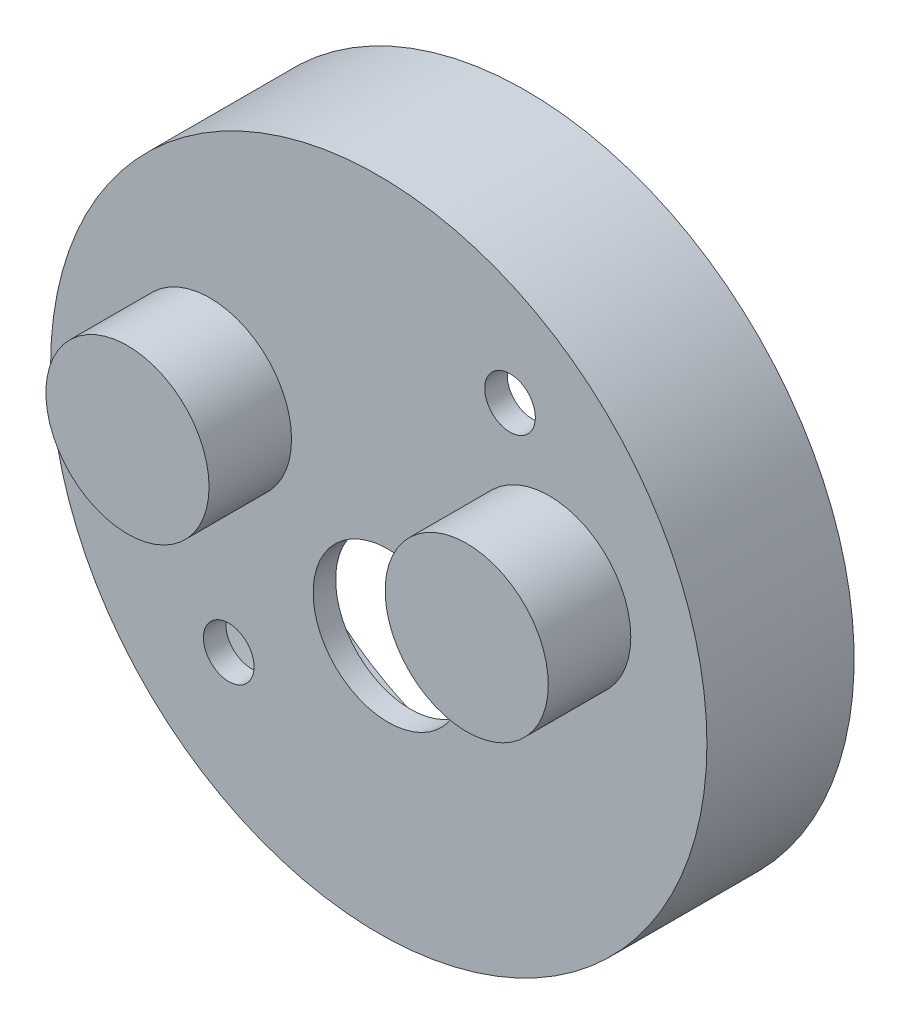
ISO-10303-21;
HEADER;
FILE_DESCRIPTION(('STEP AP214'),'2;1');
FILE_NAME('part.step','',(''),(''),'','','');
FILE_SCHEMA(('AUTOMOTIVE_DESIGN { 1 0 10303 214 1 1 1 1 }'));
ENDSEC;
DATA;
#1=APPLICATION_CONTEXT('core data for automotive mechanical design processes');
#2=APPLICATION_PROTOCOL_DEFINITION('international standard','automotive_design',2000,#1);
#3=PRODUCT_CONTEXT('',#1,'mechanical');
#4=PRODUCT('Part','Part','',(#3));
#5=PRODUCT_RELATED_PRODUCT_CATEGORY('part','',(#4));
#6=PRODUCT_DEFINITION_FORMATION('','',#4);
#7=PRODUCT_DEFINITION_CONTEXT('part definition',#1,'design');
#8=PRODUCT_DEFINITION('design','',#6,#7);
#9=PRODUCT_DEFINITION_SHAPE('','',#8);
#10=(LENGTH_UNIT() NAMED_UNIT(*) SI_UNIT(.MILLI.,.METRE.));
#11=(NAMED_UNIT(*) PLANE_ANGLE_UNIT() SI_UNIT($,.RADIAN.));
#12=(NAMED_UNIT(*) SI_UNIT($,.STERADIAN.) SOLID_ANGLE_UNIT());
#13=UNCERTAINTY_MEASURE_WITH_UNIT(LENGTH_MEASURE(1.E-05),#10,'distance_accuracy_value','');
#14=(GEOMETRIC_REPRESENTATION_CONTEXT(3) GLOBAL_UNCERTAINTY_ASSIGNED_CONTEXT((#13)) GLOBAL_UNIT_ASSIGNED_CONTEXT((#10,
#11,#12)) REPRESENTATION_CONTEXT('',''));
#15=CARTESIAN_POINT('',(0.,0.,0.));
#16=DIRECTION('',(0.,0.,1.));
#17=DIRECTION('',(1.,0.,0.));
#18=AXIS2_PLACEMENT_3D('',#15,#16,#17);
#19=CARTESIAN_POINT('',(70.0004556794782,-49.4998279755122,5.85));
#20=DIRECTION('',(0.,0.,-1.));
#21=DIRECTION('',(-1.,0.,0.));
#22=AXIS2_PLACEMENT_3D('',#19,#20,#21);
#23=CYLINDRICAL_SURFACE('',#22,17.5);
#24=CARTESIAN_POINT('',(70.0004556794782,-49.4998279755122,5.85));
#25=DIRECTION('',(0.,0.,1.));
#26=DIRECTION('',(1.,0.,0.));
#27=AXIS2_PLACEMENT_3D('',#24,#25,#26);
#28=CIRCLE('',#27,17.5);
#29=CARTESIAN_POINT('',(87.5004556794782,-49.4998279755122,5.85));
#30=VERTEX_POINT('',#29);
#31=EDGE_CURVE('E10',#30,#30,#28,.T.);
#32=ORIENTED_EDGE('',*,*,#31,.F.);
#33=EDGE_LOOP('',(#32));
#34=FACE_BOUND('',#33,.T.);
#35=CARTESIAN_POINT('',(70.0004556794782,-49.4998279755122,-2.));
#36=DIRECTION('',(0.,0.,-1.));
#37=DIRECTION('',(-1.,0.,0.));
#38=AXIS2_PLACEMENT_3D('',#35,#36,#37);
#39=CIRCLE('',#38,17.5);
#40=CARTESIAN_POINT('',(52.5004556794782,-49.4998279755122,-2.));
#41=VERTEX_POINT('',#40);
#42=EDGE_CURVE('E98',#41,#41,#39,.T.);
#43=ORIENTED_EDGE('',*,*,#42,.F.);
#44=EDGE_LOOP('',(#43));
#45=FACE_BOUND('',#44,.T.);
#46=ADVANCED_FACE('F43',(#34,#45),#23,.T.);
#47=CARTESIAN_POINT('',(70.0004556794782,-49.4998279755122,5.85));
#48=DIRECTION('',(0.,0.,1.));
#49=DIRECTION('',(1.,0.,0.));
#50=AXIS2_PLACEMENT_3D('',#47,#48,#49);
#51=PLANE('',#50);
#52=CARTESIAN_POINT('',(77.,-39.0000376139426,5.85));
#53=DIRECTION('',(0.,0.,1.));
#54=DIRECTION('',(1.,0.,0.));
#55=AXIS2_PLACEMENT_3D('',#52,#53,#54);
#56=CIRCLE('',#55,1.35000000000001);
#57=CARTESIAN_POINT('',(78.35,-39.0000376139426,5.85));
#58=VERTEX_POINT('',#57);
#59=EDGE_CURVE('E63',#58,#58,#56,.F.);
#60=ORIENTED_EDGE('',*,*,#59,.T.);
#61=EDGE_LOOP('',(#60));
#62=FACE_BOUND('',#61,.T.);
#63=CARTESIAN_POINT('',(62.,-58.0169590659114,5.85));
#64=DIRECTION('',(0.,0.,1.));
#65=DIRECTION('',(1.,0.,0.));
#66=AXIS2_PLACEMENT_3D('',#63,#64,#65);
#67=CIRCLE('',#66,1.35000000000001);
#68=CARTESIAN_POINT('',(63.35,-58.0169590659114,5.85));
#69=VERTEX_POINT('',#68);
#70=EDGE_CURVE('E68',#69,#69,#67,.F.);
#71=ORIENTED_EDGE('',*,*,#70,.T.);
#72=EDGE_LOOP('',(#71));
#73=FACE_BOUND('',#72,.T.);
#74=CARTESIAN_POINT('',(70.5,-53.,5.85));
#75=DIRECTION('',(0.,0.,1.));
#76=DIRECTION('',(1.,0.,0.));
#77=AXIS2_PLACEMENT_3D('',#74,#75,#76);
#78=CIRCLE('',#77,4.00000000000001);
#79=CARTESIAN_POINT('',(74.5,-53.,5.85));
#80=VERTEX_POINT('',#79);
#81=EDGE_CURVE('E71',#80,#80,#78,.F.);
#82=ORIENTED_EDGE('',*,*,#81,.T.);
#83=EDGE_LOOP('',(#82));
#84=FACE_BOUND('',#83,.T.);
#85=CARTESIAN_POINT('',(79.090811,-46.590809,5.85));
#86=DIRECTION('',(0.,0.,1.));
#87=DIRECTION('',(1.,0.,0.));
#88=AXIS2_PLACEMENT_3D('',#85,#86,#87);
#89=CIRCLE('',#88,4.35000000000001);
#90=CARTESIAN_POINT('',(83.440811,-46.590809,5.85));
#91=VERTEX_POINT('',#90);
#92=EDGE_CURVE('E50',#91,#91,#89,.F.);
#93=ORIENTED_EDGE('',*,*,#92,.T.);
#94=EDGE_LOOP('',(#93));
#95=FACE_BOUND('',#94,.T.);
#96=CARTESIAN_POINT('',(61.,-46.5,5.85));
#97=DIRECTION('',(0.,0.,1.));
#98=DIRECTION('',(1.,0.,0.));
#99=AXIS2_PLACEMENT_3D('',#96,#97,#98);
#100=CIRCLE('',#99,4.35000000000001);
#101=CARTESIAN_POINT('',(65.35,-46.5,5.85));
#102=VERTEX_POINT('',#101);
#103=EDGE_CURVE('E54',#102,#102,#100,.F.);
#104=ORIENTED_EDGE('',*,*,#103,.T.);
#105=EDGE_LOOP('',(#104));
#106=FACE_BOUND('',#105,.T.);
#107=ORIENTED_EDGE('',*,*,#31,.T.);
#108=EDGE_LOOP('',(#107));
#109=FACE_BOUND('',#108,.T.);
#110=ADVANCED_FACE('F106',(#62,#73,#84,#95,#106,#109),#51,.T.);
#111=CARTESIAN_POINT('',(61.,-46.5,10.25));
#112=DIRECTION('',(0.,0.,-1.));
#113=DIRECTION('',(-1.,0.,0.));
#114=AXIS2_PLACEMENT_3D('',#111,#112,#113);
#115=CYLINDRICAL_SURFACE('',#114,4.35000000000001);
#116=ORIENTED_EDGE('',*,*,#103,.F.);
#117=EDGE_LOOP('',(#116));
#118=FACE_BOUND('',#117,.T.);
#119=CARTESIAN_POINT('',(61.,-46.5,10.25));
#120=DIRECTION('',(0.,0.,1.));
#121=DIRECTION('',(1.,0.,0.));
#122=AXIS2_PLACEMENT_3D('',#119,#120,#121);
#123=CIRCLE('',#122,4.35000000000001);
#124=CARTESIAN_POINT('',(65.35,-46.5,10.25));
#125=VERTEX_POINT('',#124);
#126=EDGE_CURVE('E60',#125,#125,#123,.T.);
#127=ORIENTED_EDGE('',*,*,#126,.F.);
#128=EDGE_LOOP('',(#127));
#129=FACE_BOUND('',#128,.T.);
#130=ADVANCED_FACE('F113',(#118,#129),#115,.T.);
#131=CARTESIAN_POINT('',(61.,-46.5,10.25));
#132=DIRECTION('',(0.,0.,1.));
#133=DIRECTION('',(1.,0.,0.));
#134=AXIS2_PLACEMENT_3D('',#131,#132,#133);
#135=PLANE('',#134);
#136=ORIENTED_EDGE('',*,*,#126,.T.);
#137=EDGE_LOOP('',(#136));
#138=FACE_BOUND('',#137,.T.);
#139=ADVANCED_FACE('F120',(#138),#135,.T.);
#140=CARTESIAN_POINT('',(79.090811,-46.590809,10.25));
#141=DIRECTION('',(0.,0.,-1.));
#142=DIRECTION('',(-1.,0.,0.));
#143=AXIS2_PLACEMENT_3D('',#140,#141,#142);
#144=CYLINDRICAL_SURFACE('',#143,4.35000000000001);
#145=ORIENTED_EDGE('',*,*,#92,.F.);
#146=EDGE_LOOP('',(#145));
#147=FACE_BOUND('',#146,.T.);
#148=CARTESIAN_POINT('',(79.090811,-46.590809,10.25));
#149=DIRECTION('',(0.,0.,1.));
#150=DIRECTION('',(1.,0.,0.));
#151=AXIS2_PLACEMENT_3D('',#148,#149,#150);
#152=CIRCLE('',#151,4.35000000000001);
#153=CARTESIAN_POINT('',(83.440811,-46.590809,10.25));
#154=VERTEX_POINT('',#153);
#155=EDGE_CURVE('E59',#154,#154,#152,.T.);
#156=ORIENTED_EDGE('',*,*,#155,.F.);
#157=EDGE_LOOP('',(#156));
#158=FACE_BOUND('',#157,.T.);
#159=ADVANCED_FACE('F126',(#147,#158),#144,.T.);
#160=CARTESIAN_POINT('',(79.090811,-46.590809,10.25));
#161=DIRECTION('',(0.,0.,1.));
#162=DIRECTION('',(1.,0.,0.));
#163=AXIS2_PLACEMENT_3D('',#160,#161,#162);
#164=PLANE('',#163);
#165=ORIENTED_EDGE('',*,*,#155,.T.);
#166=EDGE_LOOP('',(#165));
#167=FACE_BOUND('',#166,.T.);
#168=ADVANCED_FACE('F131',(#167),#164,.T.);
#169=CARTESIAN_POINT('',(70.5,-53.,9.55));
#170=DIRECTION('',(0.,0.,-1.));
#171=DIRECTION('',(-1.,0.,0.));
#172=AXIS2_PLACEMENT_3D('',#169,#170,#171);
#173=CYLINDRICAL_SURFACE('',#172,4.00000000000001);
#174=CARTESIAN_POINT('',(70.5,-53.,4.65));
#175=DIRECTION('',(0.,0.,1.));
#176=DIRECTION('',(1.,0.,0.));
#177=AXIS2_PLACEMENT_3D('',#174,#175,#176);
#178=CIRCLE('',#177,4.00000000000001);
#179=CARTESIAN_POINT('',(74.5,-53.,4.65));
#180=VERTEX_POINT('',#179);
#181=EDGE_CURVE('E78',#180,#180,#178,.T.);
#182=ORIENTED_EDGE('',*,*,#181,.F.);
#183=EDGE_LOOP('',(#182));
#184=FACE_BOUND('',#183,.T.);
#185=ORIENTED_EDGE('',*,*,#81,.F.);
#186=EDGE_LOOP('',(#185));
#187=FACE_BOUND('',#186,.T.);
#188=ADVANCED_FACE('F134',(#184,#187),#173,.F.);
#189=CARTESIAN_POINT('',(62.,-58.0169590659114,9.55));
#190=DIRECTION('',(0.,0.,-1.));
#191=DIRECTION('',(-1.,0.,0.));
#192=AXIS2_PLACEMENT_3D('',#189,#190,#191);
#193=CYLINDRICAL_SURFACE('',#192,1.35000000000001);
#194=CARTESIAN_POINT('',(62.,-58.0169590659114,4.65));
#195=DIRECTION('',(0.,0.,1.));
#196=DIRECTION('',(1.,0.,0.));
#197=AXIS2_PLACEMENT_3D('',#194,#195,#196);
#198=CIRCLE('',#197,1.35000000000001);
#199=CARTESIAN_POINT('',(63.35,-58.0169590659114,4.65));
#200=VERTEX_POINT('',#199);
#201=EDGE_CURVE('E89',#200,#200,#198,.T.);
#202=ORIENTED_EDGE('',*,*,#201,.F.);
#203=EDGE_LOOP('',(#202));
#204=FACE_BOUND('',#203,.T.);
#205=ORIENTED_EDGE('',*,*,#70,.F.);
#206=EDGE_LOOP('',(#205));
#207=FACE_BOUND('',#206,.T.);
#208=ADVANCED_FACE('F138',(#204,#207),#193,.F.);
#209=CARTESIAN_POINT('',(77.,-39.0000376139426,9.55));
#210=DIRECTION('',(0.,0.,-1.));
#211=DIRECTION('',(-1.,0.,0.));
#212=AXIS2_PLACEMENT_3D('',#209,#210,#211);
#213=CYLINDRICAL_SURFACE('',#212,1.35000000000001);
#214=CARTESIAN_POINT('',(77.,-39.0000376139426,4.65));
#215=DIRECTION('',(0.,0.,1.));
#216=DIRECTION('',(1.,0.,0.));
#217=AXIS2_PLACEMENT_3D('',#214,#215,#216);
#218=CIRCLE('',#217,1.35000000000001);
#219=CARTESIAN_POINT('',(78.35,-39.0000376139426,4.65));
#220=VERTEX_POINT('',#219);
#221=EDGE_CURVE('E46',#220,#220,#218,.T.);
#222=ORIENTED_EDGE('',*,*,#221,.F.);
#223=EDGE_LOOP('',(#222));
#224=FACE_BOUND('',#223,.T.);
#225=ORIENTED_EDGE('',*,*,#59,.F.);
#226=EDGE_LOOP('',(#225));
#227=FACE_BOUND('',#226,.T.);
#228=ADVANCED_FACE('F142',(#224,#227),#213,.F.);
#229=CARTESIAN_POINT('',(70.0004556794782,-49.4998279755122,4.65));
#230=DIRECTION('',(0.,0.,-1.));
#231=DIRECTION('',(-1.,0.,0.));
#232=AXIS2_PLACEMENT_3D('',#229,#230,#231);
#233=CYLINDRICAL_SURFACE('',#232,15.5);
#234=CARTESIAN_POINT('',(70.0004556794782,-49.4998279755122,4.65));
#235=DIRECTION('',(0.,0.,1.));
#236=DIRECTION('',(1.,0.,0.));
#237=AXIS2_PLACEMENT_3D('',#234,#235,#236);
#238=CIRCLE('',#237,15.5);
#239=CARTESIAN_POINT('',(85.5004556794782,-49.4998279755122,4.65));
#240=VERTEX_POINT('',#239);
#241=EDGE_CURVE('E92',#240,#240,#238,.T.);
#242=ORIENTED_EDGE('',*,*,#241,.T.);
#243=EDGE_LOOP('',(#242));
#244=FACE_BOUND('',#243,.T.);
#245=CARTESIAN_POINT('',(70.0004556794782,-49.4998279755122,-2.));
#246=DIRECTION('',(0.,0.,-1.));
#247=DIRECTION('',(-1.,0.,0.));
#248=AXIS2_PLACEMENT_3D('',#245,#246,#247);
#249=CIRCLE('',#248,15.5);
#250=CARTESIAN_POINT('',(54.5004556794782,-49.4998279755122,-2.));
#251=VERTEX_POINT('',#250);
#252=EDGE_CURVE('E95',#251,#251,#249,.F.);
#253=ORIENTED_EDGE('',*,*,#252,.F.);
#254=EDGE_LOOP('',(#253));
#255=FACE_BOUND('',#254,.T.);
#256=ADVANCED_FACE('F146',(#244,#255),#233,.F.);
#257=CARTESIAN_POINT('',(70.0004556794782,-49.4998279755122,4.65));
#258=DIRECTION('',(0.,0.,1.));
#259=DIRECTION('',(1.,0.,0.));
#260=AXIS2_PLACEMENT_3D('',#257,#258,#259);
#261=PLANE('',#260);
#262=ORIENTED_EDGE('',*,*,#181,.T.);
#263=EDGE_LOOP('',(#262));
#264=FACE_BOUND('',#263,.T.);
#265=CARTESIAN_POINT('',(61.,-46.5,4.65));
#266=DIRECTION('',(0.,0.,1.));
#267=DIRECTION('',(1.,0.,0.));
#268=AXIS2_PLACEMENT_3D('',#265,#266,#267);
#269=CIRCLE('',#268,3.65);
#270=CARTESIAN_POINT('',(64.65,-46.5,4.65));
#271=VERTEX_POINT('',#270);
#272=EDGE_CURVE('E83',#271,#271,#269,.T.);
#273=ORIENTED_EDGE('',*,*,#272,.T.);
#274=EDGE_LOOP('',(#273));
#275=FACE_BOUND('',#274,.T.);
#276=CARTESIAN_POINT('',(79.090811,-46.590809,4.65));
#277=DIRECTION('',(0.,0.,1.));
#278=DIRECTION('',(1.,0.,0.));
#279=AXIS2_PLACEMENT_3D('',#276,#277,#278);
#280=CIRCLE('',#279,3.65);
#281=CARTESIAN_POINT('',(82.740811,-46.590809,4.65));
#282=VERTEX_POINT('',#281);
#283=EDGE_CURVE('E86',#282,#282,#280,.T.);
#284=ORIENTED_EDGE('',*,*,#283,.T.);
#285=EDGE_LOOP('',(#284));
#286=FACE_BOUND('',#285,.T.);
#287=ORIENTED_EDGE('',*,*,#201,.T.);
#288=EDGE_LOOP('',(#287));
#289=FACE_BOUND('',#288,.T.);
#290=ORIENTED_EDGE('',*,*,#221,.T.);
#291=EDGE_LOOP('',(#290));
#292=FACE_BOUND('',#291,.T.);
#293=ORIENTED_EDGE('',*,*,#241,.F.);
#294=EDGE_LOOP('',(#293));
#295=FACE_BOUND('',#294,.T.);
#296=ADVANCED_FACE('F158',(#264,#275,#286,#289,#292,#295),#261,.F.);
#297=CARTESIAN_POINT('',(79.090811,-46.590809,9.55));
#298=DIRECTION('',(0.,0.,1.));
#299=DIRECTION('',(1.,0.,0.));
#300=AXIS2_PLACEMENT_3D('',#297,#298,#299);
#301=PLANE('',#300);
#302=CARTESIAN_POINT('',(79.090811,-46.590809,9.55));
#303=DIRECTION('',(0.,0.,1.));
#304=DIRECTION('',(1.,0.,0.));
#305=AXIS2_PLACEMENT_3D('',#302,#303,#304);
#306=CIRCLE('',#305,3.65);
#307=CARTESIAN_POINT('',(82.740811,-46.590809,9.55));
#308=VERTEX_POINT('',#307);
#309=EDGE_CURVE('E74',#308,#308,#306,.T.);
#310=ORIENTED_EDGE('',*,*,#309,.F.);
#311=EDGE_LOOP('',(#310));
#312=FACE_BOUND('',#311,.T.);
#313=ADVANCED_FACE('F155',(#312),#301,.F.);
#314=CARTESIAN_POINT('',(79.090811,-46.590809,9.55));
#315=DIRECTION('',(0.,0.,-1.));
#316=DIRECTION('',(-1.,0.,0.));
#317=AXIS2_PLACEMENT_3D('',#314,#315,#316);
#318=CYLINDRICAL_SURFACE('',#317,3.65);
#319=ORIENTED_EDGE('',*,*,#283,.F.);
#320=EDGE_LOOP('',(#319));
#321=FACE_BOUND('',#320,.T.);
#322=ORIENTED_EDGE('',*,*,#309,.T.);
#323=EDGE_LOOP('',(#322));
#324=FACE_BOUND('',#323,.T.);
#325=ADVANCED_FACE('F151',(#321,#324),#318,.F.);
#326=CARTESIAN_POINT('',(61.,-46.5,9.55));
#327=DIRECTION('',(0.,0.,1.));
#328=DIRECTION('',(1.,0.,0.));
#329=AXIS2_PLACEMENT_3D('',#326,#327,#328);
#330=PLANE('',#329);
#331=CARTESIAN_POINT('',(61.,-46.5,9.55));
#332=DIRECTION('',(0.,0.,1.));
#333=DIRECTION('',(1.,0.,0.));
#334=AXIS2_PLACEMENT_3D('',#331,#332,#333);
#335=CIRCLE('',#334,3.65);
#336=CARTESIAN_POINT('',(64.65,-46.5,9.55));
#337=VERTEX_POINT('',#336);
#338=EDGE_CURVE('E75',#337,#337,#335,.T.);
#339=ORIENTED_EDGE('',*,*,#338,.F.);
#340=EDGE_LOOP('',(#339));
#341=FACE_BOUND('',#340,.T.);
#342=ADVANCED_FACE('F148',(#341),#330,.F.);
#343=CARTESIAN_POINT('',(61.,-46.5,9.55));
#344=DIRECTION('',(0.,0.,-1.));
#345=DIRECTION('',(-1.,0.,0.));
#346=AXIS2_PLACEMENT_3D('',#343,#344,#345);
#347=CYLINDRICAL_SURFACE('',#346,3.65);
#348=ORIENTED_EDGE('',*,*,#272,.F.);
#349=EDGE_LOOP('',(#348));
#350=FACE_BOUND('',#349,.T.);
#351=ORIENTED_EDGE('',*,*,#338,.T.);
#352=EDGE_LOOP('',(#351));
#353=FACE_BOUND('',#352,.T.);
#354=ADVANCED_FACE('F150',(#350,#353),#347,.F.);
#355=CARTESIAN_POINT('',(0.,0.,-2.));
#356=DIRECTION('',(0.,0.,-1.));
#357=DIRECTION('',(-1.,0.,0.));
#358=AXIS2_PLACEMENT_3D('',#355,#356,#357);
#359=PLANE('',#358);
#360=ORIENTED_EDGE('',*,*,#42,.T.);
#361=EDGE_LOOP('',(#360));
#362=FACE_BOUND('',#361,.T.);
#363=ORIENTED_EDGE('',*,*,#252,.T.);
#364=EDGE_LOOP('',(#363));
#365=FACE_BOUND('',#364,.T.);
#366=ADVANCED_FACE('F102',(#362,#365),#359,.T.);
#367=CLOSED_SHELL('',(#46,#110,#130,#139,#159,#168,#188,#208,#228,#256,#296,#313,#325,#342,#354,#366));
#368=MANIFOLD_SOLID_BREP('B2',#367);
#369=ADVANCED_BREP_SHAPE_REPRESENTATION('',(#18,#368),#14);
#370=SHAPE_DEFINITION_REPRESENTATION(#9,#369);
ENDSEC;
END-ISO-10303-21;
